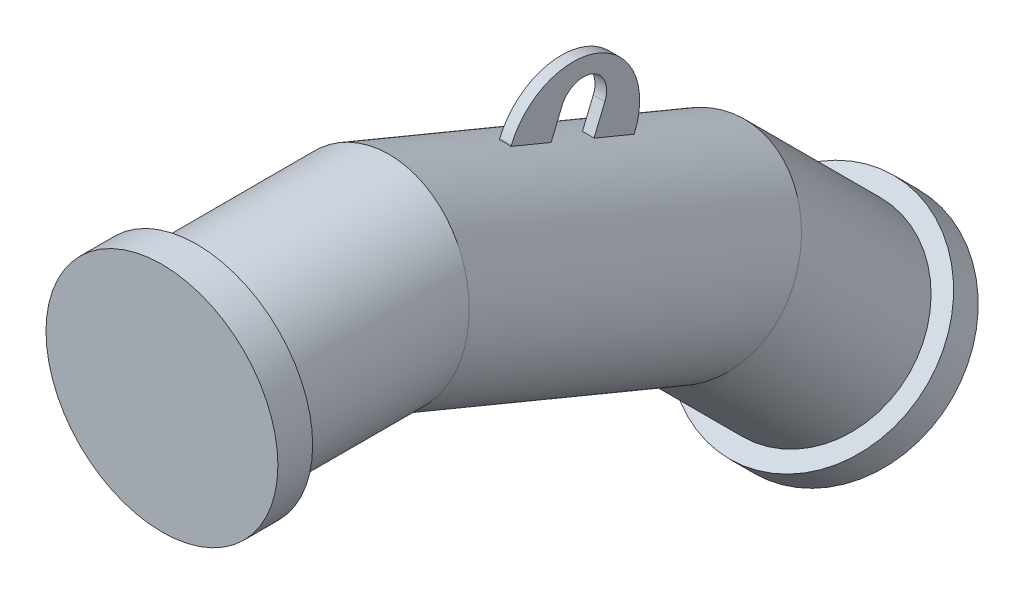
ISO-10303-21;
HEADER;
FILE_DESCRIPTION(('STEP AP214'),'2;1');
FILE_NAME('part.step','',(''),(''),'','','');
FILE_SCHEMA(('AUTOMOTIVE_DESIGN { 1 0 10303 214 1 1 1 1 }'));
ENDSEC;
DATA;
#1=APPLICATION_CONTEXT('core data for automotive mechanical design processes');
#2=APPLICATION_PROTOCOL_DEFINITION('international standard','automotive_design',2000,#1);
#3=PRODUCT_CONTEXT('',#1,'mechanical');
#4=PRODUCT('Part','Part','',(#3));
#5=PRODUCT_RELATED_PRODUCT_CATEGORY('part','',(#4));
#6=PRODUCT_DEFINITION_FORMATION('','',#4);
#7=PRODUCT_DEFINITION_CONTEXT('part definition',#1,'design');
#8=PRODUCT_DEFINITION('design','',#6,#7);
#9=PRODUCT_DEFINITION_SHAPE('','',#8);
#10=(LENGTH_UNIT() NAMED_UNIT(*) SI_UNIT(.MILLI.,.METRE.));
#11=(NAMED_UNIT(*) PLANE_ANGLE_UNIT() SI_UNIT($,.RADIAN.));
#12=(NAMED_UNIT(*) SI_UNIT($,.STERADIAN.) SOLID_ANGLE_UNIT());
#13=UNCERTAINTY_MEASURE_WITH_UNIT(LENGTH_MEASURE(1.E-05),#10,'distance_accuracy_value','');
#14=(GEOMETRIC_REPRESENTATION_CONTEXT(3) GLOBAL_UNCERTAINTY_ASSIGNED_CONTEXT((#13)) GLOBAL_UNIT_ASSIGNED_CONTEXT((#10,
#11,#12)) REPRESENTATION_CONTEXT('',''));
#15=CARTESIAN_POINT('',(0.,0.,0.));
#16=DIRECTION('',(0.,0.,1.));
#17=DIRECTION('',(1.,0.,0.));
#18=AXIS2_PLACEMENT_3D('',#15,#16,#17);
#19=CARTESIAN_POINT('',(2.46764880078773E-13,-240.883117545687,-581.543289325507));
#20=DIRECTION('',(0.,-0.707106781186549,-0.707106781186548));
#21=DIRECTION('',(1.,0.,0.));
#22=AXIS2_PLACEMENT_3D('',#19,#20,#21);
#23=PLANE('',#22);
#24=CARTESIAN_POINT('',(2.46764880078773E-13,-240.883117545687,-581.543289325507));
#25=DIRECTION('',(0.,-0.707106781186549,-0.707106781186548));
#26=DIRECTION('',(1.,0.,0.));
#27=AXIS2_PLACEMENT_3D('',#24,#25,#26);
#28=CIRCLE('',#27,100.);
#29=CARTESIAN_POINT('',(100.,-240.883117545687,-581.543289325507));
#30=VERTEX_POINT('',#29);
#31=EDGE_CURVE('E20',#30,#30,#28,.T.);
#32=ORIENTED_EDGE('',*,*,#31,.T.);
#33=EDGE_LOOP('',(#32));
#34=FACE_BOUND('',#33,.T.);
#35=ADVANCED_FACE('F16',(#34),#23,.T.);
#36=CARTESIAN_POINT('',(2.51357060148664E-13,-219.669914110091,-560.330085889911));
#37=DIRECTION('',(0.,-0.707106781186549,-0.707106781186548));
#38=DIRECTION('',(1.,0.,0.));
#39=AXIS2_PLACEMENT_3D('',#36,#37,#38);
#40=CYLINDRICAL_SURFACE('',#39,100.);
#41=CARTESIAN_POINT('',(2.51357060148664E-13,-219.669914110091,-560.330085889911));
#42=DIRECTION('',(0.,-0.707106781186549,-0.707106781186548));
#43=DIRECTION('',(1.,0.,0.));
#44=AXIS2_PLACEMENT_3D('',#41,#42,#43);
#45=CIRCLE('',#44,100.);
#46=CARTESIAN_POINT('',(100.,-219.669914110091,-560.330085889911));
#47=VERTEX_POINT('',#46);
#48=EDGE_CURVE('E27',#47,#47,#45,.T.);
#49=ORIENTED_EDGE('',*,*,#48,.T.);
#50=EDGE_LOOP('',(#49));
#51=FACE_BOUND('',#50,.T.);
#52=ORIENTED_EDGE('',*,*,#31,.F.);
#53=EDGE_LOOP('',(#52));
#54=FACE_BOUND('',#53,.T.);
#55=ADVANCED_FACE('F18',(#51,#54),#40,.T.);
#56=CARTESIAN_POINT('',(2.51357060148664E-13,-219.669914110091,-560.330085889911));
#57=DIRECTION('',(0.,-0.707106781186549,-0.707106781186548));
#58=DIRECTION('',(1.,0.,0.));
#59=AXIS2_PLACEMENT_3D('',#56,#57,#58);
#60=PLANE('',#59);
#61=CARTESIAN_POINT('',(2.51176463956475E-13,-219.669914110091,-560.330085889911));
#62=DIRECTION('',(0.,0.707106781186548,0.707106781186548));
#63=DIRECTION('',(1.,0.,0.));
#64=AXIS2_PLACEMENT_3D('',#61,#62,#63);
#65=CIRCLE('',#64,84.15);
#66=CARTESIAN_POINT('',(84.1500000000002,-219.669914110091,-560.330085889911));
#67=VERTEX_POINT('',#66);
#68=EDGE_CURVE('E10',#67,#67,#65,.T.);
#69=ORIENTED_EDGE('',*,*,#68,.F.);
#70=EDGE_LOOP('',(#69));
#71=FACE_BOUND('',#70,.T.);
#72=ORIENTED_EDGE('',*,*,#48,.F.);
#73=EDGE_LOOP('',(#72));
#74=FACE_BOUND('',#73,.T.);
#75=ADVANCED_FACE('F371',(#71,#74),#60,.F.);
#76=CARTESIAN_POINT('',(0.,-114.18070123307,-454.840873012891));
#77=DIRECTION('',(0.,0.382683432365089,0.923879532511287));
#78=DIRECTION('',(0.,-0.923879532511287,0.382683432365089));
#79=AXIS2_PLACEMENT_3D('',#76,#77,#78);
#80=CYLINDRICAL_SURFACE('',#79,84.15);
#81=CARTESIAN_POINT('',(0.,-49.4366819692332,-298.534983623592));
#82=DIRECTION('',(0.,0.38268343236509,0.923879532511288));
#83=DIRECTION('',(0.,-0.923879532511287,0.382683432365089));
#84=AXIS2_PLACEMENT_3D('',#81,#82,#83);
#85=CIRCLE('',#84,84.15);
#86=CARTESIAN_POINT('',(5.00000000000003,28.1704223425217,-330.680898766024));
#87=VERTEX_POINT('',#86);
#88=CARTESIAN_POINT('',(-5.00000000000006,28.1704223425217,-330.680898766024));
#89=VERTEX_POINT('',#88);
#90=EDGE_CURVE('E350',#87,#89,#85,.T.);
#91=ORIENTED_EDGE('',*,*,#90,.F.);
#92=DIRECTION('',(0.,0.382683432365089,0.923879532511287));
#93=VECTOR('',#92,1.);
#94=CARTESIAN_POINT('',(5.00000000000003,-36.5735969213147,-486.986788155323));
#95=LINE('',#94,#93);
#96=CARTESIAN_POINT('',(5.,42.5210510562123,-296.03541629685));
#97=VERTEX_POINT('',#96);
#98=EDGE_CURVE('E346',#87,#97,#95,.T.);
#99=ORIENTED_EDGE('',*,*,#98,.T.);
#100=CARTESIAN_POINT('',(0.,-35.0860532555421,-263.889501154418));
#101=DIRECTION('',(0.,-0.382683432365092,-0.923879532511286));
#102=DIRECTION('',(0.,0.923879532511286,-0.382683432365092));
#103=AXIS2_PLACEMENT_3D('',#100,#101,#102);
#104=CIRCLE('',#103,84.15);
#105=CARTESIAN_POINT('',(-5.00000000000003,42.5210510562123,-296.03541629685));
#106=VERTEX_POINT('',#105);
#107=EDGE_CURVE('E338',#106,#97,#104,.T.);
#108=ORIENTED_EDGE('',*,*,#107,.F.);
#109=DIRECTION('',(0.,0.382683432365089,0.923879532511287));
#110=VECTOR('',#109,1.);
#111=CARTESIAN_POINT('',(-5.00000000000009,-36.5735969213148,-486.986788155323));
#112=LINE('',#111,#110);
#113=EDGE_CURVE('E342',#89,#106,#112,.T.);
#114=ORIENTED_EDGE('',*,*,#113,.F.);
#115=EDGE_LOOP('',(#91,#99,#108,#114));
#116=FACE_BOUND('',#115,.T.);
#117=CARTESIAN_POINT('',(0.,-114.18070123307,-454.840873012891));
#118=DIRECTION('',(0.,-0.555570233019602,-0.831469612302545));
#119=DIRECTION('',(0.,-0.831469612302546,0.555570233019602));
#120=AXIS2_PLACEMENT_3D('',#117,#118,#119);
#121=ELLIPSE('',#120,85.79859596323,84.15);
#122=CARTESIAN_POINT('',(0.,-185.519626554719,-407.173727060845));
#123=VERTEX_POINT('',#122);
#124=EDGE_CURVE('E326',#123,#123,#121,.T.);
#125=ORIENTED_EDGE('',*,*,#124,.F.);
#126=EDGE_LOOP('',(#125));
#127=FACE_BOUND('',#126,.T.);
#128=CARTESIAN_POINT('',(0.,1.11022302462516E-13,-179.184275534743));
#129=DIRECTION('',(0.,-0.195090322016128,-0.980785280403231));
#130=DIRECTION('',(0.,-0.98078528040323,0.195090322016127));
#131=AXIS2_PLACEMENT_3D('',#128,#129,#130);
#132=ELLIPSE('',#131,85.79859596323,84.15);
#133=CARTESIAN_POINT('',(0.,-84.1499999999999,-162.445799819745));
#134=VERTEX_POINT('',#133);
#135=EDGE_CURVE('E331',#134,#134,#132,.T.);
#136=ORIENTED_EDGE('',*,*,#135,.T.);
#137=EDGE_LOOP('',(#136));
#138=FACE_BOUND('',#137,.T.);
#139=CARTESIAN_POINT('',(0.,-64.7440192638367,-335.490164924043));
#140=DIRECTION('',(0.,-0.38268343236509,-0.923879532511289));
#141=DIRECTION('',(0.,0.923879532511287,-0.382683432365089));
#142=AXIS2_PLACEMENT_3D('',#139,#140,#141);
#143=CIRCLE('',#142,84.15);
#144=CARTESIAN_POINT('',(-5.00000000000005,12.8630850479182,-367.636080066475));
#145=VERTEX_POINT('',#144);
#146=CARTESIAN_POINT('',(5.00000000000003,12.8630850479182,-367.636080066475));
#147=VERTEX_POINT('',#146);
#148=EDGE_CURVE('E48',#145,#147,#143,.T.);
#149=ORIENTED_EDGE('',*,*,#148,.F.);
#150=CARTESIAN_POINT('',(-5.,-1.48754366577299,-402.281562535648));
#151=VERTEX_POINT('',#150);
#152=EDGE_CURVE('E347',#151,#145,#112,.T.);
#153=ORIENTED_EDGE('',*,*,#152,.F.);
#154=CARTESIAN_POINT('',(0.,-79.0946479775275,-370.135647393216));
#155=DIRECTION('',(0.,0.382683432365092,0.923879532511286));
#156=DIRECTION('',(0.,-0.923879532511286,0.382683432365092));
#157=AXIS2_PLACEMENT_3D('',#154,#155,#156);
#158=CIRCLE('',#157,84.15);
#159=CARTESIAN_POINT('',(5.00000000000004,-1.48754366577306,-402.281562535649));
#160=VERTEX_POINT('',#159);
#161=EDGE_CURVE('E354',#160,#151,#158,.T.);
#162=ORIENTED_EDGE('',*,*,#161,.F.);
#163=EDGE_CURVE('E40',#160,#147,#95,.T.);
#164=ORIENTED_EDGE('',*,*,#163,.T.);
#165=EDGE_LOOP('',(#149,#153,#162,#164));
#166=FACE_BOUND('',#165,.T.);
#167=ADVANCED_FACE('F377',(#116,#127,#138,#166),#80,.T.);
#168=CARTESIAN_POINT('',(0.,1.11022302462516E-13,-179.184275534743));
#169=DIRECTION('',(0.,0.,1.));
#170=DIRECTION('',(1.,0.,0.));
#171=AXIS2_PLACEMENT_3D('',#168,#169,#170);
#172=CYLINDRICAL_SURFACE('',#171,84.15);
#173=CARTESIAN_POINT('',(0.,0.,-30.));
#174=DIRECTION('',(0.,0.,-1.));
#175=DIRECTION('',(-1.,0.,0.));
#176=AXIS2_PLACEMENT_3D('',#173,#174,#175);
#177=CIRCLE('',#176,84.15);
#178=CARTESIAN_POINT('',(-84.15,0.,-30.));
#179=VERTEX_POINT('',#178);
#180=EDGE_CURVE('E267',#179,#179,#177,.T.);
#181=ORIENTED_EDGE('',*,*,#180,.T.);
#182=EDGE_LOOP('',(#181));
#183=FACE_BOUND('',#182,.T.);
#184=ORIENTED_EDGE('',*,*,#135,.F.);
#185=EDGE_LOOP('',(#184));
#186=FACE_BOUND('',#185,.T.);
#187=ADVANCED_FACE('F383',(#183,#186),#172,.T.);
#188=CARTESIAN_POINT('',(2.56969577068738E-13,-114.180701233072,-454.840873012892));
#189=DIRECTION('',(0.,-0.707106781186548,-0.707106781186548));
#190=DIRECTION('',(-1.,0.,0.));
#191=AXIS2_PLACEMENT_3D('',#188,#189,#190);
#192=CYLINDRICAL_SURFACE('',#191,84.15);
#193=ORIENTED_EDGE('',*,*,#68,.T.);
#194=EDGE_LOOP('',(#193));
#195=FACE_BOUND('',#194,.T.);
#196=ORIENTED_EDGE('',*,*,#124,.T.);
#197=EDGE_LOOP('',(#196));
#198=FACE_BOUND('',#197,.T.);
#199=ADVANCED_FACE('F386',(#195,#198),#192,.T.);
#200=CARTESIAN_POINT('',(5.00000000000001,43.1505786609394,-358.533726685429));
#201=DIRECTION('',(1.,0.,0.));
#202=DIRECTION('',(0.,0.923879532511285,-0.382683432365091));
#203=AXIS2_PLACEMENT_3D('',#200,#201,#202);
#204=PLANE('',#203);
#205=ORIENTED_EDGE('',*,*,#163,.F.);
#206=DIRECTION('',(0.,0.923879532511286,-0.382683432365092));
#207=VECTOR('',#206,1.);
#208=CARTESIAN_POINT('',(5.00000000000004,-9.80368303918171,-398.836904820598));
#209=LINE('',#208,#207);
#210=CARTESIAN_POINT('',(5.00000000000004,-0.564887714068683,-402.663739144249));
#211=VERTEX_POINT('',#210);
#212=EDGE_CURVE('E277',#160,#211,#209,.T.);
#213=ORIENTED_EDGE('',*,*,#212,.T.);
#214=CARTESIAN_POINT('',(5.00000000000003,21.4394096469243,-349.54066602485));
#215=DIRECTION('',(1.,0.,0.));
#216=DIRECTION('',(0.,0.923879532511285,-0.382683432365091));
#217=AXIS2_PLACEMENT_3D('',#214,#215,#216);
#218=CIRCLE('',#217,57.5);
#219=CARTESIAN_POINT('',(5.,43.4437070079168,-296.417592905451));
#220=VERTEX_POINT('',#219);
#221=EDGE_CURVE('E295',#211,#220,#218,.T.);
#222=ORIENTED_EDGE('',*,*,#221,.T.);
#223=DIRECTION('',(0.,0.923879532511286,-0.382683432365092));
#224=VECTOR('',#223,1.);
#225=CARTESIAN_POINT('',(5.00000000000001,34.204911682804,-292.5907585818));
#226=LINE('',#225,#224);
#227=EDGE_CURVE('E271',#97,#220,#226,.T.);
#228=ORIENTED_EDGE('',*,*,#227,.F.);
#229=ORIENTED_EDGE('',*,*,#98,.F.);
#230=DIRECTION('',(0.,0.923879532511285,-0.382683432365092));
#231=VECTOR('',#230,1.);
#232=CARTESIAN_POINT('',(5.00000000000002,29.0930782942259,-331.063075374624));
#233=LINE('',#232,#231);
#234=CARTESIAN_POINT('',(5.00000000000002,50.8042473082413,-340.056136035204));
#235=VERTEX_POINT('',#234);
#236=EDGE_CURVE('E284',#87,#235,#233,.T.);
#237=ORIENTED_EDGE('',*,*,#236,.T.);
#238=CARTESIAN_POINT('',(5.00000000000001,43.1505786609394,-358.533726685429));
#239=DIRECTION('',(-1.,0.,0.));
#240=DIRECTION('',(0.,0.923879532511285,-0.382683432365091));
#241=AXIS2_PLACEMENT_3D('',#238,#239,#240);
#242=CIRCLE('',#241,20.);
#243=CARTESIAN_POINT('',(5.00000000000002,35.4969100136378,-377.011317335655));
#244=VERTEX_POINT('',#243);
#245=EDGE_CURVE('E287',#235,#244,#242,.T.);
#246=ORIENTED_EDGE('',*,*,#245,.T.);
#247=DIRECTION('',(0.,-0.923879532511285,0.382683432365091));
#248=VECTOR('',#247,1.);
#249=CARTESIAN_POINT('',(5.00000000000003,13.7857409996224,-368.018256675075));
#250=LINE('',#249,#248);
#251=EDGE_CURVE('E291',#244,#147,#250,.T.);
#252=ORIENTED_EDGE('',*,*,#251,.T.);
#253=EDGE_LOOP('',(#205,#213,#222,#228,#229,#237,#246,#252));
#254=FACE_BOUND('',#253,.T.);
#255=ADVANCED_FACE('F393',(#254),#204,.T.);
#256=CARTESIAN_POINT('',(-5.00000000000002,43.1505786609396,-358.533726685429));
#257=DIRECTION('',(1.,0.,0.));
#258=DIRECTION('',(0.,0.923879532511285,-0.382683432365091));
#259=AXIS2_PLACEMENT_3D('',#256,#257,#258);
#260=PLANE('',#259);
#261=DIRECTION('',(0.,0.923879532511286,-0.382683432365092));
#262=VECTOR('',#261,1.);
#263=CARTESIAN_POINT('',(-5.,-9.80368303918165,-398.836904820598));
#264=LINE('',#263,#262);
#265=CARTESIAN_POINT('',(-5.,-0.56488771406879,-402.663739144249));
#266=VERTEX_POINT('',#265);
#267=EDGE_CURVE('E280',#151,#266,#264,.T.);
#268=ORIENTED_EDGE('',*,*,#267,.F.);
#269=ORIENTED_EDGE('',*,*,#152,.T.);
#270=DIRECTION('',(0.,-0.923879532511285,0.382683432365091));
#271=VECTOR('',#270,1.);
#272=CARTESIAN_POINT('',(-5.00000000000001,13.7857409996224,-368.018256675075));
#273=LINE('',#272,#271);
#274=CARTESIAN_POINT('',(-5.00000000000002,35.4969100136378,-377.011317335655));
#275=VERTEX_POINT('',#274);
#276=EDGE_CURVE('E305',#275,#145,#273,.T.);
#277=ORIENTED_EDGE('',*,*,#276,.F.);
#278=CARTESIAN_POINT('',(-5.00000000000002,43.1505786609396,-358.533726685429));
#279=DIRECTION('',(-1.,0.,0.));
#280=DIRECTION('',(0.,0.923879532511285,-0.382683432365091));
#281=AXIS2_PLACEMENT_3D('',#278,#279,#280);
#282=CIRCLE('',#281,20.);
#283=CARTESIAN_POINT('',(-5.00000000000002,50.8042473082412,-340.056136035204));
#284=VERTEX_POINT('',#283);
#285=EDGE_CURVE('E302',#284,#275,#282,.T.);
#286=ORIENTED_EDGE('',*,*,#285,.F.);
#287=DIRECTION('',(0.,0.923879532511285,-0.382683432365092));
#288=VECTOR('',#287,1.);
#289=CARTESIAN_POINT('',(-5.00000000000002,29.0930782942258,-331.063075374624));
#290=LINE('',#289,#288);
#291=EDGE_CURVE('E283',#89,#284,#290,.T.);
#292=ORIENTED_EDGE('',*,*,#291,.F.);
#293=ORIENTED_EDGE('',*,*,#113,.T.);
#294=DIRECTION('',(0.,0.923879532511286,-0.382683432365092));
#295=VECTOR('',#294,1.);
#296=CARTESIAN_POINT('',(-5.00000000000003,34.204911682804,-292.590758581799));
#297=LINE('',#296,#295);
#298=CARTESIAN_POINT('',(-5.00000000000003,43.4437070079169,-296.41759290545));
#299=VERTEX_POINT('',#298);
#300=EDGE_CURVE('E274',#106,#299,#297,.T.);
#301=ORIENTED_EDGE('',*,*,#300,.T.);
#302=CARTESIAN_POINT('',(-5.00000000000001,21.4394096469242,-349.54066602485));
#303=DIRECTION('',(1.,0.,0.));
#304=DIRECTION('',(0.,0.923879532511285,-0.382683432365091));
#305=AXIS2_PLACEMENT_3D('',#302,#303,#304);
#306=CIRCLE('',#305,57.5);
#307=EDGE_CURVE('E288',#266,#299,#306,.T.);
#308=ORIENTED_EDGE('',*,*,#307,.F.);
#309=EDGE_LOOP('',(#268,#269,#277,#286,#292,#293,#301,#308));
#310=FACE_BOUND('',#309,.T.);
#311=ADVANCED_FACE('F399',(#310),#260,.F.);
#312=CARTESIAN_POINT('',(5.00000000000002,29.0930782942259,-331.063075374624));
#313=DIRECTION('',(0.,0.38268343236509,0.923879532511288));
#314=DIRECTION('',(0.,-0.923879532511285,0.382683432365092));
#315=AXIS2_PLACEMENT_3D('',#312,#313,#314);
#316=PLANE('',#315);
#317=ORIENTED_EDGE('',*,*,#236,.F.);
#318=ORIENTED_EDGE('',*,*,#90,.T.);
#319=ORIENTED_EDGE('',*,*,#291,.T.);
#320=DIRECTION('',(-1.,0.,0.));
#321=VECTOR('',#320,1.);
#322=CARTESIAN_POINT('',(5.00000000000002,50.8042473082413,-340.056136035204));
#323=LINE('',#322,#321);
#324=EDGE_CURVE('E323',#235,#284,#323,.T.);
#325=ORIENTED_EDGE('',*,*,#324,.F.);
#326=EDGE_LOOP('',(#317,#318,#319,#325));
#327=FACE_BOUND('',#326,.T.);
#328=ADVANCED_FACE('F395',(#327),#316,.F.);
#329=CARTESIAN_POINT('',(5.00000000000001,43.1505786609394,-358.533726685429));
#330=DIRECTION('',(-1.,0.,0.));
#331=DIRECTION('',(0.,-0.923879532511285,0.382683432365091));
#332=AXIS2_PLACEMENT_3D('',#329,#330,#331);
#333=CYLINDRICAL_SURFACE('',#332,20.);
#334=ORIENTED_EDGE('',*,*,#285,.T.);
#335=DIRECTION('',(-1.,0.,0.));
#336=VECTOR('',#335,1.);
#337=CARTESIAN_POINT('',(5.00000000000002,35.4969100136378,-377.011317335655));
#338=LINE('',#337,#336);
#339=EDGE_CURVE('E319',#244,#275,#338,.T.);
#340=ORIENTED_EDGE('',*,*,#339,.F.);
#341=ORIENTED_EDGE('',*,*,#245,.F.);
#342=ORIENTED_EDGE('',*,*,#324,.T.);
#343=EDGE_LOOP('',(#334,#340,#341,#342));
#344=FACE_BOUND('',#343,.T.);
#345=ADVANCED_FACE('F398',(#344),#333,.F.);
#346=CARTESIAN_POINT('',(5.00000000000003,13.7857409996224,-368.018256675075));
#347=DIRECTION('',(0.,-0.38268343236509,-0.923879532511289));
#348=DIRECTION('',(0.,0.923879532511285,-0.382683432365091));
#349=AXIS2_PLACEMENT_3D('',#346,#347,#348);
#350=PLANE('',#349);
#351=ORIENTED_EDGE('',*,*,#276,.T.);
#352=ORIENTED_EDGE('',*,*,#148,.T.);
#353=ORIENTED_EDGE('',*,*,#251,.F.);
#354=ORIENTED_EDGE('',*,*,#339,.T.);
#355=EDGE_LOOP('',(#351,#352,#353,#354));
#356=FACE_BOUND('',#355,.T.);
#357=ADVANCED_FACE('F403',(#356),#350,.F.);
#358=CARTESIAN_POINT('',(5.00000000000003,21.4394096469243,-349.54066602485));
#359=DIRECTION('',(-1.,0.,0.));
#360=DIRECTION('',(0.,-0.923879532511285,0.382683432365091));
#361=AXIS2_PLACEMENT_3D('',#358,#359,#360);
#362=CYLINDRICAL_SURFACE('',#361,57.5);
#363=ORIENTED_EDGE('',*,*,#307,.T.);
#364=DIRECTION('',(-1.,0.,0.));
#365=VECTOR('',#364,1.);
#366=CARTESIAN_POINT('',(5.,43.4437070079168,-296.417592905451));
#367=LINE('',#366,#365);
#368=EDGE_CURVE('E299',#220,#299,#367,.T.);
#369=ORIENTED_EDGE('',*,*,#368,.F.);
#370=ORIENTED_EDGE('',*,*,#221,.F.);
#371=DIRECTION('',(-1.,0.,0.));
#372=VECTOR('',#371,1.);
#373=CARTESIAN_POINT('',(5.00000000000004,-0.564887714068683,-402.663739144249));
#374=LINE('',#373,#372);
#375=EDGE_CURVE('E315',#211,#266,#374,.T.);
#376=ORIENTED_EDGE('',*,*,#375,.T.);
#377=EDGE_LOOP('',(#363,#369,#370,#376));
#378=FACE_BOUND('',#377,.T.);
#379=ADVANCED_FACE('F407',(#378),#362,.T.);
#380=CARTESIAN_POINT('',(-5.,-9.80368303918165,-398.836904820598));
#381=DIRECTION('',(0.,0.382683432365092,0.923879532511286));
#382=DIRECTION('',(0.,-0.923879532511286,0.382683432365092));
#383=AXIS2_PLACEMENT_3D('',#380,#381,#382);
#384=PLANE('',#383);
#385=ORIENTED_EDGE('',*,*,#212,.F.);
#386=ORIENTED_EDGE('',*,*,#161,.T.);
#387=ORIENTED_EDGE('',*,*,#267,.T.);
#388=ORIENTED_EDGE('',*,*,#375,.F.);
#389=EDGE_LOOP('',(#385,#386,#387,#388));
#390=FACE_BOUND('',#389,.T.);
#391=ADVANCED_FACE('F411',(#390),#384,.F.);
#392=CARTESIAN_POINT('',(5.00000000000001,34.204911682804,-292.5907585818));
#393=DIRECTION('',(0.,-0.382683432365092,-0.923879532511286));
#394=DIRECTION('',(0.,0.923879532511286,-0.382683432365092));
#395=AXIS2_PLACEMENT_3D('',#392,#393,#394);
#396=PLANE('',#395);
#397=ORIENTED_EDGE('',*,*,#300,.F.);
#398=ORIENTED_EDGE('',*,*,#107,.T.);
#399=ORIENTED_EDGE('',*,*,#227,.T.);
#400=ORIENTED_EDGE('',*,*,#368,.T.);
#401=EDGE_LOOP('',(#397,#398,#399,#400));
#402=FACE_BOUND('',#401,.T.);
#403=ADVANCED_FACE('F421',(#402),#396,.F.);
#404=CARTESIAN_POINT('',(0.,0.,-30.));
#405=DIRECTION('',(0.,0.,1.));
#406=DIRECTION('',(1.,0.,0.));
#407=AXIS2_PLACEMENT_3D('',#404,#405,#406);
#408=CYLINDRICAL_SURFACE('',#407,100.);
#409=CARTESIAN_POINT('',(0.,0.,-30.));
#410=DIRECTION('',(0.,0.,1.));
#411=DIRECTION('',(1.,0.,0.));
#412=AXIS2_PLACEMENT_3D('',#409,#410,#411);
#413=CIRCLE('',#412,100.);
#414=CARTESIAN_POINT('',(100.,0.,-30.));
#415=VERTEX_POINT('',#414);
#416=EDGE_CURVE('E263',#415,#415,#413,.T.);
#417=ORIENTED_EDGE('',*,*,#416,.T.);
#418=EDGE_LOOP('',(#417));
#419=FACE_BOUND('',#418,.T.);
#420=CARTESIAN_POINT('',(0.,0.,0.));
#421=DIRECTION('',(0.,0.,1.));
#422=DIRECTION('',(1.,0.,0.));
#423=AXIS2_PLACEMENT_3D('',#420,#421,#422);
#424=CIRCLE('',#423,100.);
#425=CARTESIAN_POINT('',(100.,0.,0.));
#426=VERTEX_POINT('',#425);
#427=EDGE_CURVE('E259',#426,#426,#424,.T.);
#428=ORIENTED_EDGE('',*,*,#427,.F.);
#429=EDGE_LOOP('',(#428));
#430=FACE_BOUND('',#429,.T.);
#431=ADVANCED_FACE('F425',(#419,#430),#408,.T.);
#432=CARTESIAN_POINT('',(0.,0.,-30.));
#433=DIRECTION('',(0.,0.,1.));
#434=DIRECTION('',(1.,0.,0.));
#435=AXIS2_PLACEMENT_3D('',#432,#433,#434);
#436=PLANE('',#435);
#437=ORIENTED_EDGE('',*,*,#180,.F.);
#438=EDGE_LOOP('',(#437));
#439=FACE_BOUND('',#438,.T.);
#440=ORIENTED_EDGE('',*,*,#416,.F.);
#441=EDGE_LOOP('',(#440));
#442=FACE_BOUND('',#441,.T.);
#443=ADVANCED_FACE('F429',(#439,#442),#436,.F.);
#444=CARTESIAN_POINT('',(0.,0.,0.));
#445=DIRECTION('',(0.,0.,1.));
#446=DIRECTION('',(1.,0.,0.));
#447=AXIS2_PLACEMENT_3D('',#444,#445,#446);
#448=PLANE('',#447);
#449=ORIENTED_EDGE('',*,*,#427,.T.);
#450=EDGE_LOOP('',(#449));
#451=FACE_BOUND('',#450,.T.);
#452=ADVANCED_FACE('F431',(#451),#448,.T.);
#453=CLOSED_SHELL('',(#35,#55,#75,#167,#187,#199,#255,#311,#328,#345,#357,#379,#391,#403,#431,
#443,#452));
#454=CARTESIAN_POINT('',(0.,0.,-30.));
#455=DIRECTION('',(0.,0.,1.));
#456=DIRECTION('',(1.,0.,0.));
#457=AXIS2_PLACEMENT_3D('',#454,#455,#456);
#458=PLANE('',#457);
#459=CARTESIAN_POINT('',(0.,0.,-30.));
#460=DIRECTION('',(0.,0.,1.));
#461=DIRECTION('',(1.,0.,0.));
#462=AXIS2_PLACEMENT_3D('',#459,#460,#461);
#463=CIRCLE('',#462,39.5);
#464=CARTESIAN_POINT('',(39.5,0.,-30.));
#465=VERTEX_POINT('',#464);
#466=EDGE_CURVE('E202',#465,#465,#463,.T.);
#467=ORIENTED_EDGE('',*,*,#466,.T.);
#468=EDGE_LOOP('',(#467));
#469=FACE_BOUND('',#468,.T.);
#470=CARTESIAN_POINT('',(0.,0.,-30.));
#471=DIRECTION('',(0.,0.,-1.));
#472=DIRECTION('',(0.,1.,0.));
#473=AXIS2_PLACEMENT_3D('',#470,#471,#472);
#474=CIRCLE('',#473,40.);
#475=CARTESIAN_POINT('',(0.,40.,-30.));
#476=VERTEX_POINT('',#475);
#477=EDGE_CURVE('E254',#476,#476,#474,.T.);
#478=ORIENTED_EDGE('',*,*,#477,.T.);
#479=EDGE_LOOP('',(#478));
#480=FACE_BOUND('',#479,.T.);
#481=ADVANCED_FACE('F442',(#469,#480),#458,.F.);
#482=CARTESIAN_POINT('',(0.,-750.,-30.));
#483=DIRECTION('',(-1.,0.,0.));
#484=DIRECTION('',(0.,0.,1.));
#485=AXIS2_PLACEMENT_3D('',#482,#483,#484);
#486=TOROIDAL_SURFACE('',#485,750.,40.);
#487=CARTESIAN_POINT('',(2.51176463956475E-13,-219.669914110091,-560.330085889911));
#488=DIRECTION('',(0.,0.707106781186547,0.707106781186548));
#489=DIRECTION('',(0.,0.707106781186547,-0.707106781186548));
#490=AXIS2_PLACEMENT_3D('',#487,#488,#489);
#491=CIRCLE('',#490,40.);
#492=CARTESIAN_POINT('',(2.64572542034154E-13,-191.385642862628,-588.614357137374));
#493=VERTEX_POINT('',#492);
#494=EDGE_CURVE('E255',#493,#493,#491,.T.);
#495=CARTESIAN_POINT('',(0.,-750.,-30.));
#496=DIRECTION('',(-1.,0.,0.));
#497=DIRECTION('',(0.,0.,1.));
#498=AXIS2_PLACEMENT_3D('',#495,#496,#497);
#499=CIRCLE('',#498,790.);
#500=EDGE_CURVE('',#476,#493,#499,.T.);
#501=ORIENTED_EDGE('',*,*,#477,.F.);
#502=ORIENTED_EDGE('',*,*,#494,.F.);
#503=ORIENTED_EDGE('',*,*,#500,.T.);
#504=ORIENTED_EDGE('',*,*,#500,.F.);
#505=EDGE_LOOP('',(#501,#503,#502,#504));
#506=FACE_BOUND('',#505,.T.);
#507=ADVANCED_FACE('F438',(#506),#486,.F.);
#508=CARTESIAN_POINT('',(2.51357060148664E-13,-219.669914110091,-560.330085889911));
#509=DIRECTION('',(0.,-0.707106781186549,-0.707106781186548));
#510=DIRECTION('',(1.,0.,0.));
#511=AXIS2_PLACEMENT_3D('',#508,#509,#510);
#512=PLANE('',#511);
#513=CARTESIAN_POINT('',(2.51357060148664E-13,-219.669914110091,-560.330085889911));
#514=DIRECTION('',(0.,-0.707106781186549,-0.707106781186548));
#515=DIRECTION('',(1.,0.,0.));
#516=AXIS2_PLACEMENT_3D('',#513,#514,#515);
#517=CIRCLE('',#516,39.5);
#518=CARTESIAN_POINT('',(39.5000000000002,-219.669914110091,-560.330085889911));
#519=VERTEX_POINT('',#518);
#520=EDGE_CURVE('E639',#519,#519,#517,.T.);
#521=ORIENTED_EDGE('',*,*,#520,.T.);
#522=EDGE_LOOP('',(#521));
#523=FACE_BOUND('',#522,.T.);
#524=ORIENTED_EDGE('',*,*,#494,.T.);
#525=EDGE_LOOP('',(#524));
#526=FACE_BOUND('',#525,.T.);
#527=ADVANCED_FACE('F441',(#523,#526),#512,.F.);
#528=CARTESIAN_POINT('',(2.50591696803682E-13,-223.205448016024,-563.865619795844));
#529=DIRECTION('',(0.,-0.707106781186548,-0.707106781186548));
#530=DIRECTION('',(0.,0.707106781186548,-0.707106781186548));
#531=AXIS2_PLACEMENT_3D('',#528,#529,#530);
#532=PLANE('',#531);
#533=CARTESIAN_POINT('',(2.50591696803682E-13,-223.205448016024,-563.865619795844));
#534=DIRECTION('',(0.,-0.707106781186548,-0.707106781186548));
#535=DIRECTION('',(0.,0.707106781186548,-0.707106781186548));
#536=AXIS2_PLACEMENT_3D('',#533,#534,#535);
#537=CIRCLE('',#536,39.5);
#538=CARTESIAN_POINT('',(2.50591696803682E-13,-195.274730159155,-591.796337652712));
#539=VERTEX_POINT('',#538);
#540=EDGE_CURVE('E195',#539,#539,#537,.F.);
#541=ORIENTED_EDGE('',*,*,#540,.T.);
#542=EDGE_LOOP('',(#541));
#543=FACE_BOUND('',#542,.T.);
#544=ADVANCED_FACE('F447',(#543),#532,.F.);
#545=CARTESIAN_POINT('',(2.51357060148664E-13,-219.669914110091,-560.330085889911));
#546=DIRECTION('',(0.,-0.707106781186549,-0.707106781186548));
#547=DIRECTION('',(1.,0.,0.));
#548=AXIS2_PLACEMENT_3D('',#545,#546,#547);
#549=CYLINDRICAL_SURFACE('',#548,39.5);
#550=ORIENTED_EDGE('',*,*,#520,.F.);
#551=EDGE_LOOP('',(#550));
#552=FACE_BOUND('',#551,.T.);
#553=ORIENTED_EDGE('',*,*,#540,.F.);
#554=EDGE_LOOP('',(#553));
#555=FACE_BOUND('',#554,.T.);
#556=ADVANCED_FACE('F586',(#552,#555),#549,.F.);
#557=CARTESIAN_POINT('',(0.,0.,-25.));
#558=DIRECTION('',(0.,0.,1.));
#559=DIRECTION('',(1.,0.,0.));
#560=AXIS2_PLACEMENT_3D('',#557,#558,#559);
#561=PLANE('',#560);
#562=CARTESIAN_POINT('',(0.,0.,-25.));
#563=DIRECTION('',(0.,0.,1.));
#564=DIRECTION('',(1.,0.,0.));
#565=AXIS2_PLACEMENT_3D('',#562,#563,#564);
#566=CIRCLE('',#565,39.5);
#567=CARTESIAN_POINT('',(39.5,0.,-25.));
#568=VERTEX_POINT('',#567);
#569=EDGE_CURVE('E201',#568,#568,#566,.F.);
#570=ORIENTED_EDGE('',*,*,#569,.T.);
#571=EDGE_LOOP('',(#570));
#572=FACE_BOUND('',#571,.T.);
#573=ADVANCED_FACE('F582',(#572),#561,.F.);
#574=CARTESIAN_POINT('',(0.,0.,-30.));
#575=DIRECTION('',(0.,0.,1.));
#576=DIRECTION('',(1.,0.,0.));
#577=AXIS2_PLACEMENT_3D('',#574,#575,#576);
#578=CYLINDRICAL_SURFACE('',#577,39.5);
#579=ORIENTED_EDGE('',*,*,#466,.F.);
#580=EDGE_LOOP('',(#579));
#581=FACE_BOUND('',#580,.T.);
#582=ORIENTED_EDGE('',*,*,#569,.F.);
#583=EDGE_LOOP('',(#582));
#584=FACE_BOUND('',#583,.T.);
#585=ADVANCED_FACE('F585',(#581,#584),#578,.F.);
#586=CLOSED_SHELL('',(#481,#507,#527,#544,#556,#573,#585));
#587=CARTESIAN_POINT('',(-30.614674589207,-73.910362600903,-24.));
#588=DIRECTION('',(0.,0.,1.));
#589=DIRECTION('',(0.,-1.,0.));
#590=AXIS2_PLACEMENT_3D('',#587,#588,#589);
#591=PLANE('',#590);
#592=CARTESIAN_POINT('',(-30.614674589207,-73.910362600903,-24.));
#593=DIRECTION('',(0.,0.,1.));
#594=DIRECTION('',(1.,0.,0.));
#595=AXIS2_PLACEMENT_3D('',#592,#593,#594);
#596=CIRCLE('',#595,6.99999999999999);
#597=CARTESIAN_POINT('',(-23.614674589207,-73.910362600903,-24.));
#598=VERTEX_POINT('',#597);
#599=EDGE_CURVE('E209',#598,#598,#596,.T.);
#600=ORIENTED_EDGE('',*,*,#599,.F.);
#601=EDGE_LOOP('',(#600));
#602=FACE_BOUND('',#601,.T.);
#603=ADVANCED_FACE('F572',(#602),#591,.F.);
#604=CARTESIAN_POINT('',(-30.614674589207,-73.910362600903,-24.));
#605=DIRECTION('',(0.,0.,1.));
#606=DIRECTION('',(1.,0.,0.));
#607=AXIS2_PLACEMENT_3D('',#604,#605,#606);
#608=CONICAL_SURFACE('',#607,6.99999999999999,1.02974425867665);
#609=CARTESIAN_POINT('',(-30.614674589207,-73.910362600903,-28.2060243331928));
#610=VERTEX_POINT('',#609);
#611=VERTEX_LOOP('',#610);
#612=FACE_BOUND('',#611,.T.);
#613=ORIENTED_EDGE('',*,*,#599,.T.);
#614=EDGE_LOOP('',(#613));
#615=FACE_BOUND('',#614,.T.);
#616=ADVANCED_FACE('F575',(#612,#615),#608,.F.);
#617=CLOSED_SHELL('',(#603,#616));
#618=CARTESIAN_POINT('',(30.6146745892075,-73.9103626009029,-24.));
#619=DIRECTION('',(0.,0.,1.));
#620=DIRECTION('',(0.,-1.,0.));
#621=AXIS2_PLACEMENT_3D('',#618,#619,#620);
#622=PLANE('',#621);
#623=CARTESIAN_POINT('',(30.6146745892075,-73.9103626009029,-24.));
#624=DIRECTION('',(0.,0.,1.));
#625=DIRECTION('',(1.,0.,0.));
#626=AXIS2_PLACEMENT_3D('',#623,#624,#625);
#627=CIRCLE('',#626,6.99999999999999);
#628=CARTESIAN_POINT('',(37.6146745892075,-73.9103626009029,-24.));
#629=VERTEX_POINT('',#628);
#630=EDGE_CURVE('E214',#629,#629,#627,.T.);
#631=ORIENTED_EDGE('',*,*,#630,.F.);
#632=EDGE_LOOP('',(#631));
#633=FACE_BOUND('',#632,.T.);
#634=ADVANCED_FACE('F562',(#633),#622,.F.);
#635=CARTESIAN_POINT('',(30.6146745892075,-73.9103626009029,-24.));
#636=DIRECTION('',(0.,0.,1.));
#637=DIRECTION('',(1.,0.,0.));
#638=AXIS2_PLACEMENT_3D('',#635,#636,#637);
#639=CONICAL_SURFACE('',#638,6.99999999999999,1.02974425867665);
#640=CARTESIAN_POINT('',(30.6146745892075,-73.9103626009028,-28.206024333193));
#641=VERTEX_POINT('',#640);
#642=VERTEX_LOOP('',#641);
#643=FACE_BOUND('',#642,.T.);
#644=ORIENTED_EDGE('',*,*,#630,.T.);
#645=EDGE_LOOP('',(#644));
#646=FACE_BOUND('',#645,.T.);
#647=ADVANCED_FACE('F565',(#643,#646),#639,.F.);
#648=CLOSED_SHELL('',(#634,#647));
#649=CARTESIAN_POINT('',(73.9103626009031,-30.6146745892068,-24.0000000000001));
#650=DIRECTION('',(0.,0.,1.));
#651=DIRECTION('',(0.,-1.,0.));
#652=AXIS2_PLACEMENT_3D('',#649,#650,#651);
#653=PLANE('',#652);
#654=CARTESIAN_POINT('',(73.9103626009031,-30.6146745892068,-24.0000000000001));
#655=DIRECTION('',(0.,0.,1.));
#656=DIRECTION('',(1.,0.,0.));
#657=AXIS2_PLACEMENT_3D('',#654,#655,#656);
#658=CIRCLE('',#657,7.);
#659=CARTESIAN_POINT('',(80.9103626009031,-30.6146745892068,-24.0000000000001));
#660=VERTEX_POINT('',#659);
#661=EDGE_CURVE('E188',#660,#660,#658,.T.);
#662=ORIENTED_EDGE('',*,*,#661,.F.);
#663=EDGE_LOOP('',(#662));
#664=FACE_BOUND('',#663,.T.);
#665=ADVANCED_FACE('F552',(#664),#653,.F.);
#666=CARTESIAN_POINT('',(73.9103626009031,-30.6146745892068,-24.0000000000001));
#667=DIRECTION('',(0.,0.,1.));
#668=DIRECTION('',(1.,0.,0.));
#669=AXIS2_PLACEMENT_3D('',#666,#667,#668);
#670=CONICAL_SURFACE('',#669,7.,1.02974425867665);
#671=CARTESIAN_POINT('',(73.9103626009031,-30.6146745892068,-28.2060243331929));
#672=VERTEX_POINT('',#671);
#673=VERTEX_LOOP('',#672);
#674=FACE_BOUND('',#673,.T.);
#675=ORIENTED_EDGE('',*,*,#661,.T.);
#676=EDGE_LOOP('',(#675));
#677=FACE_BOUND('',#676,.T.);
#678=ADVANCED_FACE('F555',(#674,#677),#670,.F.);
#679=CLOSED_SHELL('',(#665,#678));
#680=CARTESIAN_POINT('',(73.9103626009027,30.6146745892077,-23.9999999999999));
#681=DIRECTION('',(0.,0.,1.));
#682=DIRECTION('',(0.,-1.,0.));
#683=AXIS2_PLACEMENT_3D('',#680,#681,#682);
#684=PLANE('',#683);
#685=CARTESIAN_POINT('',(73.9103626009027,30.6146745892077,-23.9999999999999));
#686=DIRECTION('',(0.,0.,1.));
#687=DIRECTION('',(1.,0.,0.));
#688=AXIS2_PLACEMENT_3D('',#685,#686,#687);
#689=CIRCLE('',#688,7.);
#690=CARTESIAN_POINT('',(80.9103626009027,30.6146745892077,-23.9999999999999));
#691=VERTEX_POINT('',#690);
#692=EDGE_CURVE('E179',#691,#691,#689,.T.);
#693=ORIENTED_EDGE('',*,*,#692,.F.);
#694=EDGE_LOOP('',(#693));
#695=FACE_BOUND('',#694,.T.);
#696=ADVANCED_FACE('F542',(#695),#684,.F.);
#697=CARTESIAN_POINT('',(73.9103626009027,30.6146745892077,-23.9999999999999));
#698=DIRECTION('',(0.,0.,1.));
#699=DIRECTION('',(1.,0.,0.));
#700=AXIS2_PLACEMENT_3D('',#697,#698,#699);
#701=CONICAL_SURFACE('',#700,7.,1.02974425867665);
#702=CARTESIAN_POINT('',(73.9103626009028,30.6146745892077,-28.206024333193));
#703=VERTEX_POINT('',#702);
#704=VERTEX_LOOP('',#703);
#705=FACE_BOUND('',#704,.T.);
#706=ORIENTED_EDGE('',*,*,#692,.T.);
#707=EDGE_LOOP('',(#706));
#708=FACE_BOUND('',#707,.T.);
#709=ADVANCED_FACE('F545',(#705,#708),#701,.F.);
#710=CLOSED_SHELL('',(#696,#709));
#711=CARTESIAN_POINT('',(30.6146745892065,73.9103626009033,-24.));
#712=DIRECTION('',(0.,0.,1.));
#713=DIRECTION('',(0.,-1.,0.));
#714=AXIS2_PLACEMENT_3D('',#711,#712,#713);
#715=PLANE('',#714);
#716=CARTESIAN_POINT('',(30.6146745892065,73.9103626009033,-24.));
#717=DIRECTION('',(0.,0.,1.));
#718=DIRECTION('',(1.,0.,0.));
#719=AXIS2_PLACEMENT_3D('',#716,#717,#718);
#720=CIRCLE('',#719,6.99999999999999);
#721=CARTESIAN_POINT('',(37.6146745892065,73.9103626009033,-24.));
#722=VERTEX_POINT('',#721);
#723=EDGE_CURVE('E176',#722,#722,#720,.T.);
#724=ORIENTED_EDGE('',*,*,#723,.F.);
#725=EDGE_LOOP('',(#724));
#726=FACE_BOUND('',#725,.T.);
#727=ADVANCED_FACE('F170',(#726),#715,.F.);
#728=CARTESIAN_POINT('',(30.6146745892065,73.9103626009033,-24.));
#729=DIRECTION('',(0.,0.,1.));
#730=DIRECTION('',(1.,0.,0.));
#731=AXIS2_PLACEMENT_3D('',#728,#729,#730);
#732=CONICAL_SURFACE('',#731,6.99999999999999,1.02974425867665);
#733=CARTESIAN_POINT('',(30.6146745892065,73.9103626009033,-28.206024333193));
#734=VERTEX_POINT('',#733);
#735=VERTEX_LOOP('',#734);
#736=FACE_BOUND('',#735,.T.);
#737=ORIENTED_EDGE('',*,*,#723,.T.);
#738=EDGE_LOOP('',(#737));
#739=FACE_BOUND('',#738,.T.);
#740=ADVANCED_FACE('F167',(#736,#739),#732,.F.);
#741=CLOSED_SHELL('',(#727,#740));
#742=CARTESIAN_POINT('',(-30.614674589208,73.9103626009026,-24.0000000000001));
#743=DIRECTION('',(0.,0.,1.));
#744=DIRECTION('',(0.,-1.,0.));
#745=AXIS2_PLACEMENT_3D('',#742,#743,#744);
#746=PLANE('',#745);
#747=CARTESIAN_POINT('',(-30.614674589208,73.9103626009026,-24.0000000000001));
#748=DIRECTION('',(0.,0.,1.));
#749=DIRECTION('',(1.,0.,0.));
#750=AXIS2_PLACEMENT_3D('',#747,#748,#749);
#751=CIRCLE('',#750,6.99999999999999);
#752=CARTESIAN_POINT('',(-23.614674589208,73.9103626009026,-24.0000000000001));
#753=VERTEX_POINT('',#752);
#754=EDGE_CURVE('E180',#753,#753,#751,.T.);
#755=ORIENTED_EDGE('',*,*,#754,.F.);
#756=EDGE_LOOP('',(#755));
#757=FACE_BOUND('',#756,.T.);
#758=ADVANCED_FACE('F601',(#757),#746,.F.);
#759=CARTESIAN_POINT('',(-30.614674589208,73.9103626009026,-24.0000000000001));
#760=DIRECTION('',(0.,0.,1.));
#761=DIRECTION('',(1.,0.,0.));
#762=AXIS2_PLACEMENT_3D('',#759,#760,#761);
#763=CONICAL_SURFACE('',#762,6.99999999999999,1.02974425867665);
#764=CARTESIAN_POINT('',(-30.614674589208,73.9103626009028,-28.206024333193));
#765=VERTEX_POINT('',#764);
#766=VERTEX_LOOP('',#765);
#767=FACE_BOUND('',#766,.T.);
#768=ORIENTED_EDGE('',*,*,#754,.T.);
#769=EDGE_LOOP('',(#768));
#770=FACE_BOUND('',#769,.T.);
#771=ADVANCED_FACE('F604',(#767,#770),#763,.F.);
#772=CLOSED_SHELL('',(#758,#771));
#773=CARTESIAN_POINT('',(-73.9103626009033,30.6146745892063,-24.));
#774=DIRECTION('',(0.,0.,1.));
#775=DIRECTION('',(0.,-1.,0.));
#776=AXIS2_PLACEMENT_3D('',#773,#774,#775);
#777=PLANE('',#776);
#778=CARTESIAN_POINT('',(-73.9103626009033,30.6146745892063,-24.));
#779=DIRECTION('',(0.,0.,1.));
#780=DIRECTION('',(1.,0.,0.));
#781=AXIS2_PLACEMENT_3D('',#778,#779,#780);
#782=CIRCLE('',#781,6.99999999999999);
#783=CARTESIAN_POINT('',(-66.9103626009033,30.6146745892063,-24.));
#784=VERTEX_POINT('',#783);
#785=EDGE_CURVE('E192',#784,#784,#782,.T.);
#786=ORIENTED_EDGE('',*,*,#785,.F.);
#787=EDGE_LOOP('',(#786));
#788=FACE_BOUND('',#787,.T.);
#789=ADVANCED_FACE('F591',(#788),#777,.F.);
#790=CARTESIAN_POINT('',(-73.9103626009033,30.6146745892063,-24.));
#791=DIRECTION('',(0.,0.,1.));
#792=DIRECTION('',(1.,0.,0.));
#793=AXIS2_PLACEMENT_3D('',#790,#791,#792);
#794=CONICAL_SURFACE('',#793,6.99999999999999,1.02974425867665);
#795=CARTESIAN_POINT('',(-73.9103626009033,30.6146745892063,-28.206024333193));
#796=VERTEX_POINT('',#795);
#797=VERTEX_LOOP('',#796);
#798=FACE_BOUND('',#797,.T.);
#799=ORIENTED_EDGE('',*,*,#785,.T.);
#800=EDGE_LOOP('',(#799));
#801=FACE_BOUND('',#800,.T.);
#802=ADVANCED_FACE('F594',(#798,#801),#794,.F.);
#803=CLOSED_SHELL('',(#789,#802));
#804=CARTESIAN_POINT('',(-30.6146745892067,-171.650036202155,-616.835245172085));
#805=DIRECTION('',(0.,-0.707106781186549,-0.707106781186548));
#806=DIRECTION('',(0.,0.707106781186547,-0.707106781186548));
#807=AXIS2_PLACEMENT_3D('',#804,#805,#806);
#808=PLANE('',#807);
#809=CARTESIAN_POINT('',(-30.6146745892067,-171.650036202155,-616.835245172085));
#810=DIRECTION('',(0.,-0.707106781186549,-0.707106781186548));
#811=DIRECTION('',(1.,0.,0.));
#812=AXIS2_PLACEMENT_3D('',#809,#810,#811);
#813=CIRCLE('',#812,6.99999999999999);
#814=CARTESIAN_POINT('',(-23.6146745892067,-171.650036202155,-616.835245172085));
#815=VERTEX_POINT('',#814);
#816=EDGE_CURVE('E235',#815,#815,#813,.T.);
#817=ORIENTED_EDGE('',*,*,#816,.F.);
#818=EDGE_LOOP('',(#817));
#819=FACE_BOUND('',#818,.T.);
#820=ADVANCED_FACE('F492',(#819),#808,.F.);
#821=CARTESIAN_POINT('',(-30.6146745892067,-171.650036202155,-616.835245172085));
#822=DIRECTION('',(0.,-0.707106781186549,-0.707106781186548));
#823=DIRECTION('',(1.,0.,0.));
#824=AXIS2_PLACEMENT_3D('',#821,#822,#823);
#825=CONICAL_SURFACE('',#824,6.99999999999999,1.02974425867665);
#826=CARTESIAN_POINT('',(-30.6146745892067,-168.675927874319,-613.861136844249));
#827=VERTEX_POINT('',#826);
#828=VERTEX_LOOP('',#827);
#829=FACE_BOUND('',#828,.T.);
#830=ORIENTED_EDGE('',*,*,#816,.T.);
#831=EDGE_LOOP('',(#830));
#832=FACE_BOUND('',#831,.T.);
#833=ADVANCED_FACE('F495',(#829,#832),#825,.F.);
#834=CLOSED_SHELL('',(#820,#833));
#835=CARTESIAN_POINT('',(30.6146745892078,-171.650036202155,-616.835245172085));
#836=DIRECTION('',(0.,-0.707106781186549,-0.707106781186548));
#837=DIRECTION('',(0.,0.707106781186547,-0.707106781186548));
#838=AXIS2_PLACEMENT_3D('',#835,#836,#837);
#839=PLANE('',#838);
#840=CARTESIAN_POINT('',(30.6146745892078,-171.650036202155,-616.835245172085));
#841=DIRECTION('',(0.,-0.707106781186549,-0.707106781186548));
#842=DIRECTION('',(1.,0.,0.));
#843=AXIS2_PLACEMENT_3D('',#840,#841,#842);
#844=CIRCLE('',#843,6.99999999999999);
#845=CARTESIAN_POINT('',(37.6146745892078,-171.650036202155,-616.835245172085));
#846=VERTEX_POINT('',#845);
#847=EDGE_CURVE('E240',#846,#846,#844,.T.);
#848=ORIENTED_EDGE('',*,*,#847,.F.);
#849=EDGE_LOOP('',(#848));
#850=FACE_BOUND('',#849,.T.);
#851=ADVANCED_FACE('F482',(#850),#839,.F.);
#852=CARTESIAN_POINT('',(30.6146745892078,-171.650036202155,-616.835245172085));
#853=DIRECTION('',(0.,-0.707106781186549,-0.707106781186548));
#854=DIRECTION('',(1.,0.,0.));
#855=AXIS2_PLACEMENT_3D('',#852,#853,#854);
#856=CONICAL_SURFACE('',#855,6.99999999999999,1.02974425867665);
#857=CARTESIAN_POINT('',(30.6146745892077,-168.675927874319,-613.861136844249));
#858=VERTEX_POINT('',#857);
#859=VERTEX_LOOP('',#858);
#860=FACE_BOUND('',#859,.T.);
#861=ORIENTED_EDGE('',*,*,#847,.T.);
#862=EDGE_LOOP('',(#861));
#863=FACE_BOUND('',#862,.T.);
#864=ADVANCED_FACE('F485',(#860,#863),#856,.F.);
#865=CLOSED_SHELL('',(#851,#864));
#866=CARTESIAN_POINT('',(73.9103626009034,-202.264710791363,-586.220570582878));
#867=DIRECTION('',(0.,-0.707106781186549,-0.707106781186548));
#868=DIRECTION('',(0.,0.707106781186547,-0.707106781186548));
#869=AXIS2_PLACEMENT_3D('',#866,#867,#868);
#870=PLANE('',#869);
#871=CARTESIAN_POINT('',(73.9103626009034,-202.264710791363,-586.220570582878));
#872=DIRECTION('',(0.,-0.707106781186549,-0.707106781186548));
#873=DIRECTION('',(1.,0.,0.));
#874=AXIS2_PLACEMENT_3D('',#871,#872,#873);
#875=CIRCLE('',#874,7.);
#876=CARTESIAN_POINT('',(80.9103626009034,-202.264710791363,-586.220570582878));
#877=VERTEX_POINT('',#876);
#878=EDGE_CURVE('E244',#877,#877,#875,.T.);
#879=ORIENTED_EDGE('',*,*,#878,.F.);
#880=EDGE_LOOP('',(#879));
#881=FACE_BOUND('',#880,.T.);
#882=ADVANCED_FACE('F472',(#881),#870,.F.);
#883=CARTESIAN_POINT('',(73.9103626009034,-202.264710791363,-586.220570582878));
#884=DIRECTION('',(0.,-0.707106781186549,-0.707106781186548));
#885=DIRECTION('',(1.,0.,0.));
#886=AXIS2_PLACEMENT_3D('',#883,#884,#885);
#887=CONICAL_SURFACE('',#886,7.,1.02974425867665);
#888=CARTESIAN_POINT('',(73.9103626009033,-199.290602463526,-583.246462255041));
#889=VERTEX_POINT('',#888);
#890=VERTEX_LOOP('',#889);
#891=FACE_BOUND('',#890,.T.);
#892=ORIENTED_EDGE('',*,*,#878,.T.);
#893=EDGE_LOOP('',(#892));
#894=FACE_BOUND('',#893,.T.);
#895=ADVANCED_FACE('F475',(#891,#894),#887,.F.);
#896=CLOSED_SHELL('',(#882,#895));
#897=CARTESIAN_POINT('',(73.910362600903,-245.560398803059,-542.924882571182));
#898=DIRECTION('',(0.,-0.707106781186549,-0.707106781186548));
#899=DIRECTION('',(0.,0.707106781186547,-0.707106781186548));
#900=AXIS2_PLACEMENT_3D('',#897,#898,#899);
#901=PLANE('',#900);
#902=CARTESIAN_POINT('',(73.910362600903,-245.560398803059,-542.924882571182));
#903=DIRECTION('',(0.,-0.707106781186549,-0.707106781186548));
#904=DIRECTION('',(1.,0.,0.));
#905=AXIS2_PLACEMENT_3D('',#902,#903,#904);
#906=CIRCLE('',#905,7.);
#907=CARTESIAN_POINT('',(80.910362600903,-245.560398803059,-542.924882571182));
#908=VERTEX_POINT('',#907);
#909=EDGE_CURVE('E224',#908,#908,#906,.T.);
#910=ORIENTED_EDGE('',*,*,#909,.F.);
#911=EDGE_LOOP('',(#910));
#912=FACE_BOUND('',#911,.T.);
#913=ADVANCED_FACE('F462',(#912),#901,.F.);
#914=CARTESIAN_POINT('',(73.910362600903,-245.560398803059,-542.924882571182));
#915=DIRECTION('',(0.,-0.707106781186549,-0.707106781186548));
#916=DIRECTION('',(1.,0.,0.));
#917=AXIS2_PLACEMENT_3D('',#914,#915,#916);
#918=CONICAL_SURFACE('',#917,7.,1.02974425867665);
#919=CARTESIAN_POINT('',(73.910362600903,-242.586290475222,-539.950774243345));
#920=VERTEX_POINT('',#919);
#921=VERTEX_LOOP('',#920);
#922=FACE_BOUND('',#921,.T.);
#923=ORIENTED_EDGE('',*,*,#909,.T.);
#924=EDGE_LOOP('',(#923));
#925=FACE_BOUND('',#924,.T.);
#926=ADVANCED_FACE('F465',(#922,#925),#918,.F.);
#927=CLOSED_SHELL('',(#913,#926));
#928=CARTESIAN_POINT('',(30.6146745892067,-276.175073392266,-512.310207981975));
#929=DIRECTION('',(0.,-0.707106781186549,-0.707106781186548));
#930=DIRECTION('',(0.,0.707106781186547,-0.707106781186548));
#931=AXIS2_PLACEMENT_3D('',#928,#929,#930);
#932=PLANE('',#931);
#933=CARTESIAN_POINT('',(30.6146745892067,-276.175073392266,-512.310207981975));
#934=DIRECTION('',(0.,-0.707106781186549,-0.707106781186548));
#935=DIRECTION('',(1.,0.,0.));
#936=AXIS2_PLACEMENT_3D('',#933,#934,#935);
#937=CIRCLE('',#936,6.99999999999999);
#938=CARTESIAN_POINT('',(37.6146745892067,-276.175073392266,-512.310207981975));
#939=VERTEX_POINT('',#938);
#940=EDGE_CURVE('E220',#939,#939,#937,.T.);
#941=ORIENTED_EDGE('',*,*,#940,.F.);
#942=EDGE_LOOP('',(#941));
#943=FACE_BOUND('',#942,.T.);
#944=ADVANCED_FACE('F532',(#943),#932,.F.);
#945=CARTESIAN_POINT('',(30.6146745892067,-276.175073392266,-512.310207981975));
#946=DIRECTION('',(0.,-0.707106781186549,-0.707106781186548));
#947=DIRECTION('',(1.,0.,0.));
#948=AXIS2_PLACEMENT_3D('',#945,#946,#947);
#949=CONICAL_SURFACE('',#948,6.99999999999999,1.02974425867665);
#950=CARTESIAN_POINT('',(30.6146745892067,-273.200965064429,-509.336099654138));
#951=VERTEX_POINT('',#950);
#952=VERTEX_LOOP('',#951);
#953=FACE_BOUND('',#952,.T.);
#954=ORIENTED_EDGE('',*,*,#940,.T.);
#955=EDGE_LOOP('',(#954));
#956=FACE_BOUND('',#955,.T.);
#957=ADVANCED_FACE('F535',(#953,#956),#949,.F.);
#958=CLOSED_SHELL('',(#944,#957));
#959=CARTESIAN_POINT('',(-30.6146745892077,-276.175073392265,-512.310207981975));
#960=DIRECTION('',(0.,-0.707106781186549,-0.707106781186548));
#961=DIRECTION('',(0.,0.707106781186547,-0.707106781186548));
#962=AXIS2_PLACEMENT_3D('',#959,#960,#961);
#963=PLANE('',#962);
#964=CARTESIAN_POINT('',(-30.6146745892077,-276.175073392265,-512.310207981975));
#965=DIRECTION('',(0.,-0.707106781186549,-0.707106781186548));
#966=DIRECTION('',(1.,0.,0.));
#967=AXIS2_PLACEMENT_3D('',#964,#965,#966);
#968=CIRCLE('',#967,6.99999999999999);
#969=CARTESIAN_POINT('',(-23.6146745892078,-276.175073392265,-512.310207981975));
#970=VERTEX_POINT('',#969);
#971=EDGE_CURVE('E225',#970,#970,#968,.T.);
#972=ORIENTED_EDGE('',*,*,#971,.F.);
#973=EDGE_LOOP('',(#972));
#974=FACE_BOUND('',#973,.T.);
#975=ADVANCED_FACE('F522',(#974),#963,.F.);
#976=CARTESIAN_POINT('',(-30.6146745892077,-276.175073392265,-512.310207981975));
#977=DIRECTION('',(0.,-0.707106781186549,-0.707106781186548));
#978=DIRECTION('',(1.,0.,0.));
#979=AXIS2_PLACEMENT_3D('',#976,#977,#978);
#980=CONICAL_SURFACE('',#979,6.99999999999999,1.02974425867665);
#981=CARTESIAN_POINT('',(-30.6146745892077,-273.200965064429,-509.336099654139));
#982=VERTEX_POINT('',#981);
#983=VERTEX_LOOP('',#982);
#984=FACE_BOUND('',#983,.T.);
#985=ORIENTED_EDGE('',*,*,#971,.T.);
#986=EDGE_LOOP('',(#985));
#987=FACE_BOUND('',#986,.T.);
#988=ADVANCED_FACE('F525',(#984,#987),#980,.F.);
#989=CLOSED_SHELL('',(#975,#988));
#990=CARTESIAN_POINT('',(-73.9103626009031,-245.560398803057,-542.924882571183));
#991=DIRECTION('',(0.,-0.707106781186549,-0.707106781186548));
#992=DIRECTION('',(0.,0.707106781186547,-0.707106781186548));
#993=AXIS2_PLACEMENT_3D('',#990,#991,#992);
#994=PLANE('',#993);
#995=CARTESIAN_POINT('',(-73.9103626009031,-245.560398803057,-542.924882571183));
#996=DIRECTION('',(0.,-0.707106781186549,-0.707106781186548));
#997=DIRECTION('',(1.,0.,0.));
#998=AXIS2_PLACEMENT_3D('',#995,#996,#997);
#999=CIRCLE('',#998,6.99999999999999);
#1000=CARTESIAN_POINT('',(-66.9103626009031,-245.560398803057,-542.924882571183));
#1001=VERTEX_POINT('',#1000);
#1002=EDGE_CURVE('E229',#1001,#1001,#999,.T.);
#1003=ORIENTED_EDGE('',*,*,#1002,.F.);
#1004=EDGE_LOOP('',(#1003));
#1005=FACE_BOUND('',#1004,.T.);
#1006=ADVANCED_FACE('F512',(#1005),#994,.F.);
#1007=CARTESIAN_POINT('',(-73.9103626009031,-245.560398803057,-542.924882571183));
#1008=DIRECTION('',(0.,-0.707106781186549,-0.707106781186548));
#1009=DIRECTION('',(1.,0.,0.));
#1010=AXIS2_PLACEMENT_3D('',#1007,#1008,#1009);
#1011=CONICAL_SURFACE('',#1010,6.99999999999999,1.02974425867665);
#1012=CARTESIAN_POINT('',(-73.9103626009031,-242.586290475221,-539.950774243346));
#1013=VERTEX_POINT('',#1012);
#1014=VERTEX_LOOP('',#1013);
#1015=FACE_BOUND('',#1014,.T.);
#1016=ORIENTED_EDGE('',*,*,#1002,.T.);
#1017=EDGE_LOOP('',(#1016));
#1018=FACE_BOUND('',#1017,.T.);
#1019=ADVANCED_FACE('F515',(#1015,#1018),#1011,.F.);
#1020=CLOSED_SHELL('',(#1006,#1019));
#1021=CARTESIAN_POINT('',(-73.9103626009029,-30.6146745892073,-24.));
#1022=DIRECTION('',(0.,0.,1.));
#1023=DIRECTION('',(0.,-1.,0.));
#1024=AXIS2_PLACEMENT_3D('',#1021,#1022,#1023);
#1025=PLANE('',#1024);
#1026=CARTESIAN_POINT('',(-73.9103626009029,-30.6146745892073,-24.));
#1027=DIRECTION('',(0.,0.,1.));
#1028=DIRECTION('',(1.,0.,0.));
#1029=AXIS2_PLACEMENT_3D('',#1026,#1027,#1028);
#1030=CIRCLE('',#1029,7.);
#1031=CARTESIAN_POINT('',(-66.9103626009029,-30.6146745892073,-24.));
#1032=VERTEX_POINT('',#1031);
#1033=EDGE_CURVE('E213',#1032,#1032,#1030,.T.);
#1034=ORIENTED_EDGE('',*,*,#1033,.F.);
#1035=EDGE_LOOP('',(#1034));
#1036=FACE_BOUND('',#1035,.T.);
#1037=ADVANCED_FACE('F502',(#1036),#1025,.F.);
#1038=CARTESIAN_POINT('',(-73.9103626009029,-30.6146745892073,-24.));
#1039=DIRECTION('',(0.,0.,1.));
#1040=DIRECTION('',(1.,0.,0.));
#1041=AXIS2_PLACEMENT_3D('',#1038,#1039,#1040);
#1042=CONICAL_SURFACE('',#1041,7.,1.02974425867665);
#1043=CARTESIAN_POINT('',(-73.910362600903,-30.6146745892073,-28.2060243331929));
#1044=VERTEX_POINT('',#1043);
#1045=VERTEX_LOOP('',#1044);
#1046=FACE_BOUND('',#1045,.T.);
#1047=ORIENTED_EDGE('',*,*,#1033,.T.);
#1048=EDGE_LOOP('',(#1047));
#1049=FACE_BOUND('',#1048,.T.);
#1050=ADVANCED_FACE('F505',(#1046,#1049),#1042,.F.);
#1051=CLOSED_SHELL('',(#1037,#1050));
#1052=CARTESIAN_POINT('',(-73.9103626009027,-202.264710791362,-586.220570582878));
#1053=DIRECTION('',(0.,-0.707106781186549,-0.707106781186548));
#1054=DIRECTION('',(0.,0.707106781186547,-0.707106781186548));
#1055=AXIS2_PLACEMENT_3D('',#1052,#1053,#1054);
#1056=PLANE('',#1055);
#1057=CARTESIAN_POINT('',(-73.9103626009027,-202.264710791362,-586.220570582878));
#1058=DIRECTION('',(0.,-0.707106781186549,-0.707106781186548));
#1059=DIRECTION('',(1.,0.,0.));
#1060=AXIS2_PLACEMENT_3D('',#1057,#1058,#1059);
#1061=CIRCLE('',#1060,7.);
#1062=CARTESIAN_POINT('',(-66.9103626009027,-202.264710791362,-586.220570582878));
#1063=VERTEX_POINT('',#1062);
#1064=EDGE_CURVE('E239',#1063,#1063,#1061,.T.);
#1065=ORIENTED_EDGE('',*,*,#1064,.F.);
#1066=EDGE_LOOP('',(#1065));
#1067=FACE_BOUND('',#1066,.T.);
#1068=ADVANCED_FACE('F452',(#1067),#1056,.F.);
#1069=CARTESIAN_POINT('',(-73.9103626009027,-202.264710791362,-586.220570582878));
#1070=DIRECTION('',(0.,-0.707106781186549,-0.707106781186548));
#1071=DIRECTION('',(1.,0.,0.));
#1072=AXIS2_PLACEMENT_3D('',#1069,#1070,#1071);
#1073=CONICAL_SURFACE('',#1072,7.,1.02974425867665);
#1074=CARTESIAN_POINT('',(-73.9103626009027,-199.290602463526,-583.246462255042));
#1075=VERTEX_POINT('',#1074);
#1076=VERTEX_LOOP('',#1075);
#1077=FACE_BOUND('',#1076,.T.);
#1078=ORIENTED_EDGE('',*,*,#1064,.T.);
#1079=EDGE_LOOP('',(#1078));
#1080=FACE_BOUND('',#1079,.T.);
#1081=ADVANCED_FACE('F455',(#1077,#1080),#1073,.F.);
#1082=CLOSED_SHELL('',(#1068,#1081));
#1083=ORIENTED_CLOSED_SHELL('',*,#586,.T.);
#1084=ORIENTED_CLOSED_SHELL('',*,#617,.T.);
#1085=ORIENTED_CLOSED_SHELL('',*,#648,.T.);
#1086=ORIENTED_CLOSED_SHELL('',*,#679,.T.);
#1087=ORIENTED_CLOSED_SHELL('',*,#710,.T.);
#1088=ORIENTED_CLOSED_SHELL('',*,#741,.T.);
#1089=ORIENTED_CLOSED_SHELL('',*,#772,.T.);
#1090=ORIENTED_CLOSED_SHELL('',*,#803,.T.);
#1091=ORIENTED_CLOSED_SHELL('',*,#834,.T.);
#1092=ORIENTED_CLOSED_SHELL('',*,#865,.T.);
#1093=ORIENTED_CLOSED_SHELL('',*,#896,.T.);
#1094=ORIENTED_CLOSED_SHELL('',*,#927,.T.);
#1095=ORIENTED_CLOSED_SHELL('',*,#958,.T.);
#1096=ORIENTED_CLOSED_SHELL('',*,#989,.T.);
#1097=ORIENTED_CLOSED_SHELL('',*,#1020,.T.);
#1098=ORIENTED_CLOSED_SHELL('',*,#1051,.T.);
#1099=ORIENTED_CLOSED_SHELL('',*,#1082,.T.);
#1100=BREP_WITH_VOIDS('B1',#453,(#1083,#1084,#1085,#1086,#1087,#1088,#1089,#1090,#1091,#1092,
#1093,#1094,#1095,#1096,#1097,#1098,#1099));
#1101=ADVANCED_BREP_SHAPE_REPRESENTATION('',(#18,#1100),#14);
#1102=SHAPE_DEFINITION_REPRESENTATION(#9,#1101);
ENDSEC;
END-ISO-10303-21;
